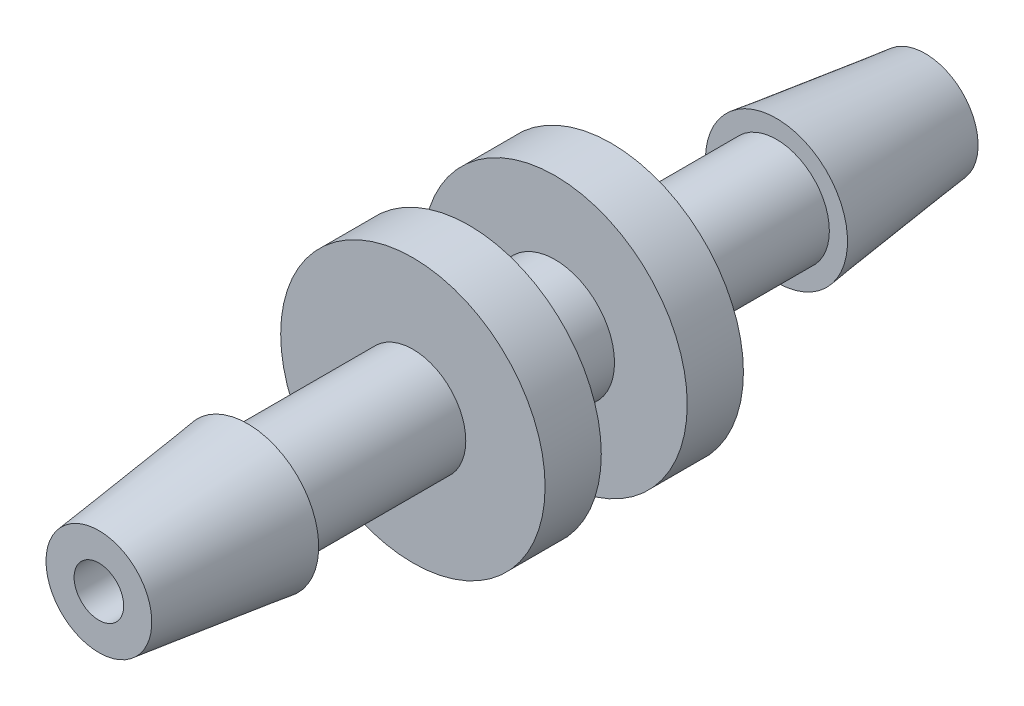
ISO-10303-21;
HEADER;
FILE_DESCRIPTION(('STEP AP214'),'2;1');
FILE_NAME('part.step','',(''),(''),'','','');
FILE_SCHEMA(('AUTOMOTIVE_DESIGN { 1 0 10303 214 1 1 1 1 }'));
ENDSEC;
DATA;
#1=APPLICATION_CONTEXT('core data for automotive mechanical design processes');
#2=APPLICATION_PROTOCOL_DEFINITION('international standard','automotive_design',2000,#1);
#3=PRODUCT_CONTEXT('',#1,'mechanical');
#4=PRODUCT('Part','Part','',(#3));
#5=PRODUCT_RELATED_PRODUCT_CATEGORY('part','',(#4));
#6=PRODUCT_DEFINITION_FORMATION('','',#4);
#7=PRODUCT_DEFINITION_CONTEXT('part definition',#1,'design');
#8=PRODUCT_DEFINITION('design','',#6,#7);
#9=PRODUCT_DEFINITION_SHAPE('','',#8);
#10=(LENGTH_UNIT() NAMED_UNIT(*) SI_UNIT(.MILLI.,.METRE.));
#11=(NAMED_UNIT(*) PLANE_ANGLE_UNIT() SI_UNIT($,.RADIAN.));
#12=(NAMED_UNIT(*) SI_UNIT($,.STERADIAN.) SOLID_ANGLE_UNIT());
#13=UNCERTAINTY_MEASURE_WITH_UNIT(LENGTH_MEASURE(1.E-05),#10,'distance_accuracy_value','');
#14=(GEOMETRIC_REPRESENTATION_CONTEXT(3) GLOBAL_UNCERTAINTY_ASSIGNED_CONTEXT((#13)) GLOBAL_UNIT_ASSIGNED_CONTEXT((#10,
#11,#12)) REPRESENTATION_CONTEXT('',''));
#15=CARTESIAN_POINT('',(0.,0.,0.));
#16=DIRECTION('',(0.,0.,1.));
#17=DIRECTION('',(1.,0.,0.));
#18=AXIS2_PLACEMENT_3D('',#15,#16,#17);
#19=CARTESIAN_POINT('',(0.,0.,3.));
#20=DIRECTION('',(0.,0.,1.));
#21=DIRECTION('',(1.,0.,0.));
#22=AXIS2_PLACEMENT_3D('',#19,#20,#21);
#23=PLANE('',#22);
#24=CARTESIAN_POINT('',(0.,0.,3.));
#25=DIRECTION('',(0.,0.,1.));
#26=DIRECTION('',(1.,0.,0.));
#27=AXIS2_PLACEMENT_3D('',#24,#25,#26);
#28=CIRCLE('',#27,4.);
#29=CARTESIAN_POINT('',(4.,0.,3.));
#30=VERTEX_POINT('',#29);
#31=EDGE_CURVE('E45',#30,#30,#28,.T.);
#32=ORIENTED_EDGE('',*,*,#31,.T.);
#33=EDGE_LOOP('',(#32));
#34=FACE_BOUND('',#33,.T.);
#35=CARTESIAN_POINT('',(0.,0.,3.));
#36=DIRECTION('',(0.,0.,1.));
#37=DIRECTION('',(1.,0.,0.));
#38=AXIS2_PLACEMENT_3D('',#35,#36,#37);
#39=CIRCLE('',#38,1.6);
#40=CARTESIAN_POINT('',(1.6,0.,3.));
#41=VERTEX_POINT('',#40);
#42=EDGE_CURVE('E55',#41,#41,#39,.T.);
#43=ORIENTED_EDGE('',*,*,#42,.F.);
#44=EDGE_LOOP('',(#43));
#45=FACE_BOUND('',#44,.T.);
#46=ADVANCED_FACE('F34',(#34,#45),#23,.T.);
#47=CARTESIAN_POINT('',(0.,0.,1.3));
#48=DIRECTION('',(0.,0.,-1.));
#49=DIRECTION('',(-1.,0.,0.));
#50=AXIS2_PLACEMENT_3D('',#47,#48,#49);
#51=CYLINDRICAL_SURFACE('',#50,1.8);
#52=CARTESIAN_POINT('',(0.,0.,1.3));
#53=DIRECTION('',(0.,0.,1.));
#54=DIRECTION('',(1.,0.,0.));
#55=AXIS2_PLACEMENT_3D('',#52,#53,#54);
#56=CIRCLE('',#55,1.8);
#57=CARTESIAN_POINT('',(1.8,0.,1.3));
#58=VERTEX_POINT('',#57);
#59=EDGE_CURVE('E41',#58,#58,#56,.T.);
#60=ORIENTED_EDGE('',*,*,#59,.F.);
#61=EDGE_LOOP('',(#60));
#62=FACE_BOUND('',#61,.T.);
#63=CARTESIAN_POINT('',(0.,0.,-1.3));
#64=DIRECTION('',(0.,0.,1.));
#65=DIRECTION('',(1.,0.,0.));
#66=AXIS2_PLACEMENT_3D('',#63,#64,#65);
#67=CIRCLE('',#66,1.8);
#68=CARTESIAN_POINT('',(1.8,0.,-1.3));
#69=VERTEX_POINT('',#68);
#70=EDGE_CURVE('E69',#69,#69,#67,.T.);
#71=ORIENTED_EDGE('',*,*,#70,.T.);
#72=EDGE_LOOP('',(#71));
#73=FACE_BOUND('',#72,.T.);
#74=ADVANCED_FACE('F36',(#62,#73),#51,.T.);
#75=CARTESIAN_POINT('',(0.,0.,1.3));
#76=DIRECTION('',(0.,0.,-1.));
#77=DIRECTION('',(-1.,0.,0.));
#78=AXIS2_PLACEMENT_3D('',#75,#76,#77);
#79=CYLINDRICAL_SURFACE('',#78,0.75);
#80=CARTESIAN_POINT('',(0.,0.,12.5));
#81=DIRECTION('',(0.,0.,-1.));
#82=DIRECTION('',(-1.,0.,0.));
#83=AXIS2_PLACEMENT_3D('',#80,#81,#82);
#84=CIRCLE('',#83,0.75);
#85=CARTESIAN_POINT('',(-0.749999999999998,0.,12.5));
#86=VERTEX_POINT('',#85);
#87=EDGE_CURVE('E66',#86,#86,#84,.T.);
#88=ORIENTED_EDGE('',*,*,#87,.F.);
#89=EDGE_LOOP('',(#88));
#90=FACE_BOUND('',#89,.T.);
#91=CARTESIAN_POINT('',(0.,0.,-12.5));
#92=DIRECTION('',(0.,0.,-1.));
#93=DIRECTION('',(-1.,0.,0.));
#94=AXIS2_PLACEMENT_3D('',#91,#92,#93);
#95=CIRCLE('',#94,0.75);
#96=CARTESIAN_POINT('',(-0.749999999999998,0.,-12.5));
#97=VERTEX_POINT('',#96);
#98=EDGE_CURVE('E87',#97,#97,#95,.T.);
#99=ORIENTED_EDGE('',*,*,#98,.T.);
#100=EDGE_LOOP('',(#99));
#101=FACE_BOUND('',#100,.T.);
#102=ADVANCED_FACE('F91',(#90,#101),#79,.F.);
#103=CARTESIAN_POINT('',(0.,0.,1.3));
#104=DIRECTION('',(0.,0.,1.));
#105=DIRECTION('',(1.,0.,0.));
#106=AXIS2_PLACEMENT_3D('',#103,#104,#105);
#107=PLANE('',#106);
#108=ORIENTED_EDGE('',*,*,#59,.T.);
#109=EDGE_LOOP('',(#108));
#110=FACE_BOUND('',#109,.T.);
#111=CARTESIAN_POINT('',(0.,0.,1.3));
#112=DIRECTION('',(0.,0.,1.));
#113=DIRECTION('',(1.,0.,0.));
#114=AXIS2_PLACEMENT_3D('',#111,#112,#113);
#115=CIRCLE('',#114,4.);
#116=CARTESIAN_POINT('',(4.,0.,1.3));
#117=VERTEX_POINT('',#116);
#118=EDGE_CURVE('E49',#117,#117,#115,.T.);
#119=ORIENTED_EDGE('',*,*,#118,.F.);
#120=EDGE_LOOP('',(#119));
#121=FACE_BOUND('',#120,.T.);
#122=ADVANCED_FACE('F116',(#110,#121),#107,.F.);
#123=CARTESIAN_POINT('',(0.,0.,3.));
#124=DIRECTION('',(0.,0.,-1.));
#125=DIRECTION('',(-1.,0.,0.));
#126=AXIS2_PLACEMENT_3D('',#123,#124,#125);
#127=CYLINDRICAL_SURFACE('',#126,4.);
#128=ORIENTED_EDGE('',*,*,#31,.F.);
#129=EDGE_LOOP('',(#128));
#130=FACE_BOUND('',#129,.T.);
#131=ORIENTED_EDGE('',*,*,#118,.T.);
#132=EDGE_LOOP('',(#131));
#133=FACE_BOUND('',#132,.T.);
#134=ADVANCED_FACE('F119',(#130,#133),#127,.T.);
#135=CARTESIAN_POINT('',(0.,0.,8.));
#136=DIRECTION('',(0.,0.,-1.));
#137=DIRECTION('',(-1.,0.,0.));
#138=AXIS2_PLACEMENT_3D('',#135,#136,#137);
#139=CYLINDRICAL_SURFACE('',#138,1.6);
#140=CARTESIAN_POINT('',(0.,0.,8.));
#141=DIRECTION('',(0.,0.,1.));
#142=DIRECTION('',(1.,0.,0.));
#143=AXIS2_PLACEMENT_3D('',#140,#141,#142);
#144=CIRCLE('',#143,1.6);
#145=CARTESIAN_POINT('',(1.6,0.,8.));
#146=VERTEX_POINT('',#145);
#147=EDGE_CURVE('E53',#146,#146,#144,.T.);
#148=ORIENTED_EDGE('',*,*,#147,.F.);
#149=EDGE_LOOP('',(#148));
#150=FACE_BOUND('',#149,.T.);
#151=ORIENTED_EDGE('',*,*,#42,.T.);
#152=EDGE_LOOP('',(#151));
#153=FACE_BOUND('',#152,.T.);
#154=ADVANCED_FACE('F114',(#150,#153),#139,.T.);
#155=CARTESIAN_POINT('',(0.750000000000001,0.,8.));
#156=DIRECTION('',(0.,0.,1.));
#157=DIRECTION('',(1.,0.,0.));
#158=AXIS2_PLACEMENT_3D('',#155,#156,#157);
#159=PLANE('',#158);
#160=ORIENTED_EDGE('',*,*,#147,.T.);
#161=EDGE_LOOP('',(#160));
#162=FACE_BOUND('',#161,.T.);
#163=CARTESIAN_POINT('',(0.,0.,8.));
#164=DIRECTION('',(0.,0.,-1.));
#165=DIRECTION('',(-1.,0.,0.));
#166=AXIS2_PLACEMENT_3D('',#163,#164,#165);
#167=CIRCLE('',#166,2.15);
#168=CARTESIAN_POINT('',(-2.15,0.,8.));
#169=VERTEX_POINT('',#168);
#170=EDGE_CURVE('E58',#169,#169,#167,.T.);
#171=ORIENTED_EDGE('',*,*,#170,.T.);
#172=EDGE_LOOP('',(#171));
#173=FACE_BOUND('',#172,.T.);
#174=ADVANCED_FACE('F141',(#162,#173),#159,.F.);
#175=CARTESIAN_POINT('',(0.,0.,12.5));
#176=DIRECTION('',(0.,0.,-1.));
#177=DIRECTION('',(-1.,0.,0.));
#178=AXIS2_PLACEMENT_3D('',#175,#176,#177);
#179=CONICAL_SURFACE('',#178,1.6,0.121619023261347);
#180=ORIENTED_EDGE('',*,*,#170,.F.);
#181=EDGE_LOOP('',(#180));
#182=FACE_BOUND('',#181,.T.);
#183=CARTESIAN_POINT('',(0.,0.,12.5));
#184=DIRECTION('',(0.,0.,-1.));
#185=DIRECTION('',(-1.,0.,0.));
#186=AXIS2_PLACEMENT_3D('',#183,#184,#185);
#187=CIRCLE('',#186,1.6);
#188=CARTESIAN_POINT('',(-1.6,0.,12.5));
#189=VERTEX_POINT('',#188);
#190=EDGE_CURVE('E63',#189,#189,#187,.T.);
#191=ORIENTED_EDGE('',*,*,#190,.T.);
#192=EDGE_LOOP('',(#191));
#193=FACE_BOUND('',#192,.T.);
#194=ADVANCED_FACE('F131',(#182,#193),#179,.T.);
#195=CARTESIAN_POINT('',(0.750000000000002,0.,12.5));
#196=DIRECTION('',(0.,0.,-1.));
#197=DIRECTION('',(-1.,0.,0.));
#198=AXIS2_PLACEMENT_3D('',#195,#196,#197);
#199=PLANE('',#198);
#200=ORIENTED_EDGE('',*,*,#190,.F.);
#201=EDGE_LOOP('',(#200));
#202=FACE_BOUND('',#201,.T.);
#203=ORIENTED_EDGE('',*,*,#87,.T.);
#204=EDGE_LOOP('',(#203));
#205=FACE_BOUND('',#204,.T.);
#206=ADVANCED_FACE('F128',(#202,#205),#199,.F.);
#207=CARTESIAN_POINT('',(0.,0.,-3.));
#208=DIRECTION('',(0.,0.,1.));
#209=DIRECTION('',(1.,0.,0.));
#210=AXIS2_PLACEMENT_3D('',#207,#208,#209);
#211=CYLINDRICAL_SURFACE('',#210,4.);
#212=CARTESIAN_POINT('',(0.,0.,-3.));
#213=DIRECTION('',(0.,0.,1.));
#214=DIRECTION('',(1.,0.,0.));
#215=AXIS2_PLACEMENT_3D('',#212,#213,#214);
#216=CIRCLE('',#215,4.);
#217=CARTESIAN_POINT('',(4.,0.,-3.));
#218=VERTEX_POINT('',#217);
#219=EDGE_CURVE('E72',#218,#218,#216,.T.);
#220=ORIENTED_EDGE('',*,*,#219,.T.);
#221=EDGE_LOOP('',(#220));
#222=FACE_BOUND('',#221,.T.);
#223=CARTESIAN_POINT('',(0.,0.,-1.3));
#224=DIRECTION('',(0.,0.,1.));
#225=DIRECTION('',(1.,0.,0.));
#226=AXIS2_PLACEMENT_3D('',#223,#224,#225);
#227=CIRCLE('',#226,4.);
#228=CARTESIAN_POINT('',(4.,0.,-1.3));
#229=VERTEX_POINT('',#228);
#230=EDGE_CURVE('E73',#229,#229,#227,.T.);
#231=ORIENTED_EDGE('',*,*,#230,.F.);
#232=EDGE_LOOP('',(#231));
#233=FACE_BOUND('',#232,.T.);
#234=ADVANCED_FACE('F130',(#222,#233),#211,.T.);
#235=CARTESIAN_POINT('',(0.,0.,-3.));
#236=DIRECTION('',(0.,0.,-1.));
#237=DIRECTION('',(1.,0.,0.));
#238=AXIS2_PLACEMENT_3D('',#235,#236,#237);
#239=PLANE('',#238);
#240=CARTESIAN_POINT('',(0.,0.,-3.));
#241=DIRECTION('',(0.,0.,-1.));
#242=DIRECTION('',(-1.,0.,0.));
#243=AXIS2_PLACEMENT_3D('',#240,#241,#242);
#244=CIRCLE('',#243,1.6);
#245=CARTESIAN_POINT('',(-1.6,0.,-3.));
#246=VERTEX_POINT('',#245);
#247=EDGE_CURVE('E10',#246,#246,#244,.T.);
#248=ORIENTED_EDGE('',*,*,#247,.F.);
#249=EDGE_LOOP('',(#248));
#250=FACE_BOUND('',#249,.T.);
#251=ORIENTED_EDGE('',*,*,#219,.F.);
#252=EDGE_LOOP('',(#251));
#253=FACE_BOUND('',#252,.T.);
#254=ADVANCED_FACE('F138',(#250,#253),#239,.T.);
#255=CARTESIAN_POINT('',(0.,0.,-1.3));
#256=DIRECTION('',(0.,0.,-1.));
#257=DIRECTION('',(1.,0.,0.));
#258=AXIS2_PLACEMENT_3D('',#255,#256,#257);
#259=PLANE('',#258);
#260=ORIENTED_EDGE('',*,*,#70,.F.);
#261=EDGE_LOOP('',(#260));
#262=FACE_BOUND('',#261,.T.);
#263=ORIENTED_EDGE('',*,*,#230,.T.);
#264=EDGE_LOOP('',(#263));
#265=FACE_BOUND('',#264,.T.);
#266=ADVANCED_FACE('F234',(#262,#265),#259,.F.);
#267=CARTESIAN_POINT('',(0.,0.,-8.));
#268=DIRECTION('',(0.,0.,1.));
#269=DIRECTION('',(1.,0.,0.));
#270=AXIS2_PLACEMENT_3D('',#267,#268,#269);
#271=CYLINDRICAL_SURFACE('',#270,1.6);
#272=CARTESIAN_POINT('',(0.,0.,-8.));
#273=DIRECTION('',(0.,0.,1.));
#274=DIRECTION('',(1.,0.,0.));
#275=AXIS2_PLACEMENT_3D('',#272,#273,#274);
#276=CIRCLE('',#275,1.6);
#277=CARTESIAN_POINT('',(1.6,0.,-8.));
#278=VERTEX_POINT('',#277);
#279=EDGE_CURVE('E76',#278,#278,#276,.T.);
#280=ORIENTED_EDGE('',*,*,#279,.T.);
#281=EDGE_LOOP('',(#280));
#282=FACE_BOUND('',#281,.T.);
#283=ORIENTED_EDGE('',*,*,#247,.T.);
#284=EDGE_LOOP('',(#283));
#285=FACE_BOUND('',#284,.T.);
#286=ADVANCED_FACE('F244',(#282,#285),#271,.T.);
#287=CARTESIAN_POINT('',(0.750000000000001,0.,-8.));
#288=DIRECTION('',(0.,0.,-1.));
#289=DIRECTION('',(1.,0.,0.));
#290=AXIS2_PLACEMENT_3D('',#287,#288,#289);
#291=PLANE('',#290);
#292=ORIENTED_EDGE('',*,*,#279,.F.);
#293=EDGE_LOOP('',(#292));
#294=FACE_BOUND('',#293,.T.);
#295=CARTESIAN_POINT('',(0.,0.,-8.));
#296=DIRECTION('',(0.,0.,-1.));
#297=DIRECTION('',(-1.,0.,0.));
#298=AXIS2_PLACEMENT_3D('',#295,#296,#297);
#299=CIRCLE('',#298,2.15);
#300=CARTESIAN_POINT('',(-2.15,0.,-8.));
#301=VERTEX_POINT('',#300);
#302=EDGE_CURVE('E81',#301,#301,#299,.T.);
#303=ORIENTED_EDGE('',*,*,#302,.F.);
#304=EDGE_LOOP('',(#303));
#305=FACE_BOUND('',#304,.T.);
#306=ADVANCED_FACE('F101',(#294,#305),#291,.F.);
#307=CARTESIAN_POINT('',(0.,0.,-12.5));
#308=DIRECTION('',(0.,0.,1.));
#309=DIRECTION('',(-1.,0.,0.));
#310=AXIS2_PLACEMENT_3D('',#307,#308,#309);
#311=CONICAL_SURFACE('',#310,1.6,0.121619023261347);
#312=ORIENTED_EDGE('',*,*,#302,.T.);
#313=EDGE_LOOP('',(#312));
#314=FACE_BOUND('',#313,.T.);
#315=CARTESIAN_POINT('',(0.,0.,-12.5));
#316=DIRECTION('',(0.,0.,-1.));
#317=DIRECTION('',(-1.,0.,0.));
#318=AXIS2_PLACEMENT_3D('',#315,#316,#317);
#319=CIRCLE('',#318,1.6);
#320=CARTESIAN_POINT('',(-1.6,0.,-12.5));
#321=VERTEX_POINT('',#320);
#322=EDGE_CURVE('E84',#321,#321,#319,.T.);
#323=ORIENTED_EDGE('',*,*,#322,.F.);
#324=EDGE_LOOP('',(#323));
#325=FACE_BOUND('',#324,.T.);
#326=ADVANCED_FACE('F95',(#314,#325),#311,.T.);
#327=CARTESIAN_POINT('',(0.750000000000002,0.,-12.5));
#328=DIRECTION('',(0.,0.,1.));
#329=DIRECTION('',(-1.,0.,0.));
#330=AXIS2_PLACEMENT_3D('',#327,#328,#329);
#331=PLANE('',#330);
#332=ORIENTED_EDGE('',*,*,#322,.T.);
#333=EDGE_LOOP('',(#332));
#334=FACE_BOUND('',#333,.T.);
#335=ORIENTED_EDGE('',*,*,#98,.F.);
#336=EDGE_LOOP('',(#335));
#337=FACE_BOUND('',#336,.T.);
#338=ADVANCED_FACE('F93',(#334,#337),#331,.F.);
#339=CLOSED_SHELL('',(#46,#74,#102,#122,#134,#154,#174,#194,#206,#234,#254,#266,#286,#306,#326,#338));
#340=MANIFOLD_SOLID_BREP('B2',#339);
#341=ADVANCED_BREP_SHAPE_REPRESENTATION('',(#18,#340),#14);
#342=SHAPE_DEFINITION_REPRESENTATION(#9,#341);
ENDSEC;
END-ISO-10303-21;
